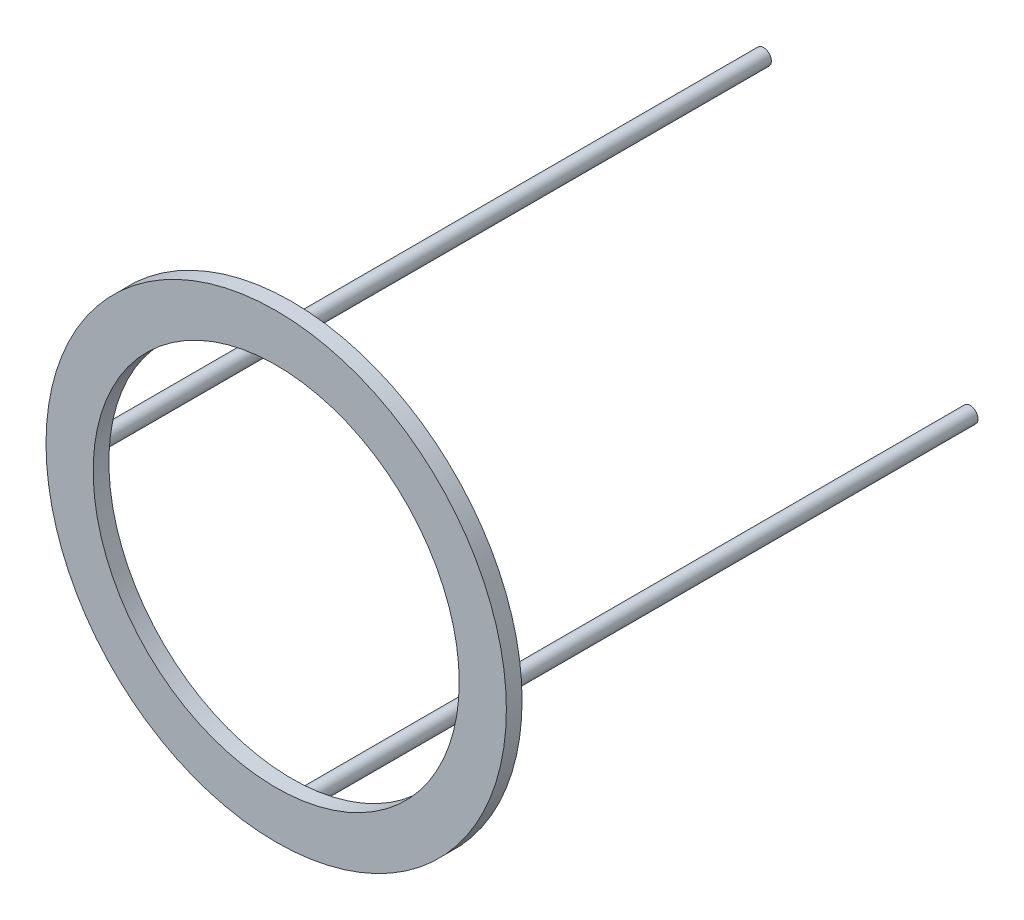
ISO-10303-21;
HEADER;
FILE_DESCRIPTION(('STEP AP214'),'2;1');
FILE_NAME('part.step','',(''),(''),'','','');
FILE_SCHEMA(('AUTOMOTIVE_DESIGN { 1 0 10303 214 1 1 1 1 }'));
ENDSEC;
DATA;
#1=APPLICATION_CONTEXT('core data for automotive mechanical design processes');
#2=APPLICATION_PROTOCOL_DEFINITION('international standard','automotive_design',2000,#1);
#3=PRODUCT_CONTEXT('',#1,'mechanical');
#4=PRODUCT('Part','Part','',(#3));
#5=PRODUCT_RELATED_PRODUCT_CATEGORY('part','',(#4));
#6=PRODUCT_DEFINITION_FORMATION('','',#4);
#7=PRODUCT_DEFINITION_CONTEXT('part definition',#1,'design');
#8=PRODUCT_DEFINITION('design','',#6,#7);
#9=PRODUCT_DEFINITION_SHAPE('','',#8);
#10=(LENGTH_UNIT() NAMED_UNIT(*) SI_UNIT(.MILLI.,.METRE.));
#11=(NAMED_UNIT(*) PLANE_ANGLE_UNIT() SI_UNIT($,.RADIAN.));
#12=(NAMED_UNIT(*) SI_UNIT($,.STERADIAN.) SOLID_ANGLE_UNIT());
#13=UNCERTAINTY_MEASURE_WITH_UNIT(LENGTH_MEASURE(1.E-05),#10,'distance_accuracy_value','');
#14=(GEOMETRIC_REPRESENTATION_CONTEXT(3) GLOBAL_UNCERTAINTY_ASSIGNED_CONTEXT((#13)) GLOBAL_UNIT_ASSIGNED_CONTEXT((#10,
#11,#12)) REPRESENTATION_CONTEXT('',''));
#15=CARTESIAN_POINT('',(0.,0.,0.));
#16=DIRECTION('',(0.,0.,1.));
#17=DIRECTION('',(1.,0.,0.));
#18=AXIS2_PLACEMENT_3D('',#15,#16,#17);
#19=CARTESIAN_POINT('',(0.,0.,0.));
#20=DIRECTION('',(0.,0.,1.));
#21=DIRECTION('',(1.,0.,0.));
#22=AXIS2_PLACEMENT_3D('',#19,#20,#21);
#23=PLANE('',#22);
#24=CARTESIAN_POINT('',(-131.42135623731,0.,0.));
#25=DIRECTION('',(0.,0.,1.));
#26=DIRECTION('',(1.,0.,0.));
#27=AXIS2_PLACEMENT_3D('',#24,#25,#26);
#28=CIRCLE('',#27,4.99999999999999);
#29=CARTESIAN_POINT('',(-126.42135623731,0.,0.));
#30=VERTEX_POINT('',#29);
#31=EDGE_CURVE('E38',#30,#30,#28,.F.);
#32=ORIENTED_EDGE('',*,*,#31,.F.);
#33=EDGE_LOOP('',(#32));
#34=FACE_BOUND('',#33,.T.);
#35=CARTESIAN_POINT('',(131.42135623731,0.,0.));
#36=DIRECTION('',(0.,0.,1.));
#37=DIRECTION('',(1.,0.,0.));
#38=AXIS2_PLACEMENT_3D('',#35,#36,#37);
#39=CIRCLE('',#38,4.99999999999999);
#40=CARTESIAN_POINT('',(136.42135623731,0.,0.));
#41=VERTEX_POINT('',#40);
#42=EDGE_CURVE('E46',#41,#41,#39,.F.);
#43=ORIENTED_EDGE('',*,*,#42,.F.);
#44=EDGE_LOOP('',(#43));
#45=FACE_BOUND('',#44,.T.);
#46=CARTESIAN_POINT('',(0.,0.,0.));
#47=DIRECTION('',(0.,0.,1.));
#48=DIRECTION('',(1.,0.,0.));
#49=AXIS2_PLACEMENT_3D('',#46,#47,#48);
#50=CIRCLE('',#49,146.42135623731);
#51=CARTESIAN_POINT('',(146.42135623731,0.,0.));
#52=VERTEX_POINT('',#51);
#53=EDGE_CURVE('E52',#52,#52,#50,.T.);
#54=ORIENTED_EDGE('',*,*,#53,.F.);
#55=EDGE_LOOP('',(#54));
#56=FACE_BOUND('',#55,.T.);
#57=CARTESIAN_POINT('',(0.,0.,0.));
#58=DIRECTION('',(0.,0.,1.));
#59=DIRECTION('',(1.,0.,0.));
#60=AXIS2_PLACEMENT_3D('',#57,#58,#59);
#61=CIRCLE('',#60,116.42135623731);
#62=CARTESIAN_POINT('',(116.42135623731,0.,0.));
#63=VERTEX_POINT('',#62);
#64=EDGE_CURVE('E58',#63,#63,#61,.T.);
#65=ORIENTED_EDGE('',*,*,#64,.T.);
#66=EDGE_LOOP('',(#65));
#67=FACE_BOUND('',#66,.T.);
#68=CARTESIAN_POINT('',(0.,131.42135623731,0.));
#69=DIRECTION('',(0.,0.,1.));
#70=DIRECTION('',(1.,0.,0.));
#71=AXIS2_PLACEMENT_3D('',#68,#69,#70);
#72=CIRCLE('',#71,5.);
#73=CARTESIAN_POINT('',(5.,131.42135623731,0.));
#74=VERTEX_POINT('',#73);
#75=EDGE_CURVE('E42',#74,#74,#72,.F.);
#76=ORIENTED_EDGE('',*,*,#75,.F.);
#77=EDGE_LOOP('',(#76));
#78=FACE_BOUND('',#77,.T.);
#79=CARTESIAN_POINT('',(0.,-131.42135623731,0.));
#80=DIRECTION('',(0.,0.,1.));
#81=DIRECTION('',(1.,0.,0.));
#82=AXIS2_PLACEMENT_3D('',#79,#80,#81);
#83=CIRCLE('',#82,5.);
#84=CARTESIAN_POINT('',(5.,-131.42135623731,0.));
#85=VERTEX_POINT('',#84);
#86=EDGE_CURVE('E10',#85,#85,#83,.F.);
#87=ORIENTED_EDGE('',*,*,#86,.F.);
#88=EDGE_LOOP('',(#87));
#89=FACE_BOUND('',#88,.T.);
#90=ADVANCED_FACE('F31',(#34,#45,#56,#67,#78,#89),#23,.F.);
#91=CARTESIAN_POINT('',(0.,0.,10.));
#92=DIRECTION('',(0.,0.,1.));
#93=DIRECTION('',(1.,0.,0.));
#94=AXIS2_PLACEMENT_3D('',#91,#92,#93);
#95=PLANE('',#94);
#96=CARTESIAN_POINT('',(0.,0.,10.));
#97=DIRECTION('',(0.,0.,1.));
#98=DIRECTION('',(1.,0.,0.));
#99=AXIS2_PLACEMENT_3D('',#96,#97,#98);
#100=CIRCLE('',#99,146.42135623731);
#101=CARTESIAN_POINT('',(146.42135623731,0.,10.));
#102=VERTEX_POINT('',#101);
#103=EDGE_CURVE('E51',#102,#102,#100,.T.);
#104=ORIENTED_EDGE('',*,*,#103,.T.);
#105=EDGE_LOOP('',(#104));
#106=FACE_BOUND('',#105,.T.);
#107=CARTESIAN_POINT('',(0.,0.,10.));
#108=DIRECTION('',(0.,0.,1.));
#109=DIRECTION('',(1.,0.,0.));
#110=AXIS2_PLACEMENT_3D('',#107,#108,#109);
#111=CIRCLE('',#110,116.42135623731);
#112=CARTESIAN_POINT('',(116.42135623731,0.,10.));
#113=VERTEX_POINT('',#112);
#114=EDGE_CURVE('E55',#113,#113,#111,.T.);
#115=ORIENTED_EDGE('',*,*,#114,.F.);
#116=EDGE_LOOP('',(#115));
#117=FACE_BOUND('',#116,.T.);
#118=ADVANCED_FACE('F91',(#106,#117),#95,.T.);
#119=CARTESIAN_POINT('',(0.,0.,10.));
#120=DIRECTION('',(0.,0.,-1.));
#121=DIRECTION('',(-1.,0.,0.));
#122=AXIS2_PLACEMENT_3D('',#119,#120,#121);
#123=CYLINDRICAL_SURFACE('',#122,146.42135623731);
#124=ORIENTED_EDGE('',*,*,#103,.F.);
#125=EDGE_LOOP('',(#124));
#126=FACE_BOUND('',#125,.T.);
#127=ORIENTED_EDGE('',*,*,#53,.T.);
#128=EDGE_LOOP('',(#127));
#129=FACE_BOUND('',#128,.T.);
#130=ADVANCED_FACE('F33',(#126,#129),#123,.T.);
#131=CARTESIAN_POINT('',(0.,0.,10.));
#132=DIRECTION('',(0.,0.,-1.));
#133=DIRECTION('',(-1.,0.,0.));
#134=AXIS2_PLACEMENT_3D('',#131,#132,#133);
#135=CYLINDRICAL_SURFACE('',#134,116.42135623731);
#136=ORIENTED_EDGE('',*,*,#114,.T.);
#137=EDGE_LOOP('',(#136));
#138=FACE_BOUND('',#137,.T.);
#139=ORIENTED_EDGE('',*,*,#64,.F.);
#140=EDGE_LOOP('',(#139));
#141=FACE_BOUND('',#140,.T.);
#142=ADVANCED_FACE('F100',(#138,#141),#135,.F.);
#143=CARTESIAN_POINT('',(131.42135623731,0.,-300.));
#144=DIRECTION('',(0.,0.,1.));
#145=DIRECTION('',(1.,0.,0.));
#146=AXIS2_PLACEMENT_3D('',#143,#144,#145);
#147=CYLINDRICAL_SURFACE('',#146,4.99999999999999);
#148=CARTESIAN_POINT('',(131.42135623731,0.,-300.));
#149=DIRECTION('',(0.,0.,-1.));
#150=DIRECTION('',(-1.,0.,0.));
#151=AXIS2_PLACEMENT_3D('',#148,#149,#150);
#152=CIRCLE('',#151,4.99999999999999);
#153=CARTESIAN_POINT('',(126.42135623731,0.,-300.));
#154=VERTEX_POINT('',#153);
#155=EDGE_CURVE('E61',#154,#154,#152,.T.);
#156=ORIENTED_EDGE('',*,*,#155,.F.);
#157=EDGE_LOOP('',(#156));
#158=FACE_BOUND('',#157,.T.);
#159=ORIENTED_EDGE('',*,*,#42,.T.);
#160=EDGE_LOOP('',(#159));
#161=FACE_BOUND('',#160,.T.);
#162=ADVANCED_FACE('F103',(#158,#161),#147,.T.);
#163=CARTESIAN_POINT('',(131.42135623731,0.,-300.));
#164=DIRECTION('',(0.,0.,-1.));
#165=DIRECTION('',(-1.,0.,0.));
#166=AXIS2_PLACEMENT_3D('',#163,#164,#165);
#167=PLANE('',#166);
#168=ORIENTED_EDGE('',*,*,#155,.T.);
#169=EDGE_LOOP('',(#168));
#170=FACE_BOUND('',#169,.T.);
#171=ADVANCED_FACE('F107',(#170),#167,.T.);
#172=CARTESIAN_POINT('',(0.,131.42135623731,-300.));
#173=DIRECTION('',(0.,0.,1.));
#174=DIRECTION('',(1.,0.,0.));
#175=AXIS2_PLACEMENT_3D('',#172,#173,#174);
#176=CYLINDRICAL_SURFACE('',#175,5.);
#177=CARTESIAN_POINT('',(0.,131.42135623731,-300.));
#178=DIRECTION('',(0.,0.,-1.));
#179=DIRECTION('',(-1.,0.,0.));
#180=AXIS2_PLACEMENT_3D('',#177,#178,#179);
#181=CIRCLE('',#180,5.);
#182=CARTESIAN_POINT('',(-5.,131.42135623731,-300.));
#183=VERTEX_POINT('',#182);
#184=EDGE_CURVE('E66',#183,#183,#181,.T.);
#185=ORIENTED_EDGE('',*,*,#184,.F.);
#186=EDGE_LOOP('',(#185));
#187=FACE_BOUND('',#186,.T.);
#188=ORIENTED_EDGE('',*,*,#75,.T.);
#189=EDGE_LOOP('',(#188));
#190=FACE_BOUND('',#189,.T.);
#191=ADVANCED_FACE('F111',(#187,#190),#176,.T.);
#192=CARTESIAN_POINT('',(0.,131.42135623731,-300.));
#193=DIRECTION('',(0.,0.,-1.));
#194=DIRECTION('',(-1.,0.,0.));
#195=AXIS2_PLACEMENT_3D('',#192,#193,#194);
#196=PLANE('',#195);
#197=ORIENTED_EDGE('',*,*,#184,.T.);
#198=EDGE_LOOP('',(#197));
#199=FACE_BOUND('',#198,.T.);
#200=ADVANCED_FACE('F115',(#199),#196,.T.);
#201=CARTESIAN_POINT('',(-131.42135623731,0.,-300.));
#202=DIRECTION('',(0.,0.,1.));
#203=DIRECTION('',(1.,0.,0.));
#204=AXIS2_PLACEMENT_3D('',#201,#202,#203);
#205=CYLINDRICAL_SURFACE('',#204,4.99999999999999);
#206=CARTESIAN_POINT('',(-131.42135623731,0.,-300.));
#207=DIRECTION('',(0.,0.,-1.));
#208=DIRECTION('',(-1.,0.,0.));
#209=AXIS2_PLACEMENT_3D('',#206,#207,#208);
#210=CIRCLE('',#209,4.99999999999999);
#211=CARTESIAN_POINT('',(-136.42135623731,0.,-300.));
#212=VERTEX_POINT('',#211);
#213=EDGE_CURVE('E69',#212,#212,#210,.T.);
#214=ORIENTED_EDGE('',*,*,#213,.F.);
#215=EDGE_LOOP('',(#214));
#216=FACE_BOUND('',#215,.T.);
#217=ORIENTED_EDGE('',*,*,#31,.T.);
#218=EDGE_LOOP('',(#217));
#219=FACE_BOUND('',#218,.T.);
#220=ADVANCED_FACE('F87',(#216,#219),#205,.T.);
#221=CARTESIAN_POINT('',(-131.42135623731,0.,-300.));
#222=DIRECTION('',(0.,0.,-1.));
#223=DIRECTION('',(-1.,0.,0.));
#224=AXIS2_PLACEMENT_3D('',#221,#222,#223);
#225=PLANE('',#224);
#226=ORIENTED_EDGE('',*,*,#213,.T.);
#227=EDGE_LOOP('',(#226));
#228=FACE_BOUND('',#227,.T.);
#229=ADVANCED_FACE('F80',(#228),#225,.T.);
#230=CARTESIAN_POINT('',(0.,-131.42135623731,-300.));
#231=DIRECTION('',(0.,0.,1.));
#232=DIRECTION('',(1.,0.,0.));
#233=AXIS2_PLACEMENT_3D('',#230,#231,#232);
#234=CYLINDRICAL_SURFACE('',#233,5.);
#235=CARTESIAN_POINT('',(0.,-131.42135623731,-300.));
#236=DIRECTION('',(0.,0.,-1.));
#237=DIRECTION('',(-1.,0.,0.));
#238=AXIS2_PLACEMENT_3D('',#235,#236,#237);
#239=CIRCLE('',#238,5.);
#240=CARTESIAN_POINT('',(-5.,-131.42135623731,-300.));
#241=VERTEX_POINT('',#240);
#242=EDGE_CURVE('E72',#241,#241,#239,.T.);
#243=ORIENTED_EDGE('',*,*,#242,.F.);
#244=EDGE_LOOP('',(#243));
#245=FACE_BOUND('',#244,.T.);
#246=ORIENTED_EDGE('',*,*,#86,.T.);
#247=EDGE_LOOP('',(#246));
#248=FACE_BOUND('',#247,.T.);
#249=ADVANCED_FACE('F78',(#245,#248),#234,.T.);
#250=CARTESIAN_POINT('',(0.,-131.42135623731,-300.));
#251=DIRECTION('',(0.,0.,-1.));
#252=DIRECTION('',(-1.,0.,0.));
#253=AXIS2_PLACEMENT_3D('',#250,#251,#252);
#254=PLANE('',#253);
#255=ORIENTED_EDGE('',*,*,#242,.T.);
#256=EDGE_LOOP('',(#255));
#257=FACE_BOUND('',#256,.T.);
#258=ADVANCED_FACE('F76',(#257),#254,.T.);
#259=CLOSED_SHELL('',(#90,#118,#130,#142,#162,#171,#191,#200,#220,#229,#249,#258));
#260=MANIFOLD_SOLID_BREP('B2',#259);
#261=ADVANCED_BREP_SHAPE_REPRESENTATION('',(#18,#260),#14);
#262=SHAPE_DEFINITION_REPRESENTATION(#9,#261);
ENDSEC;
END-ISO-10303-21;
